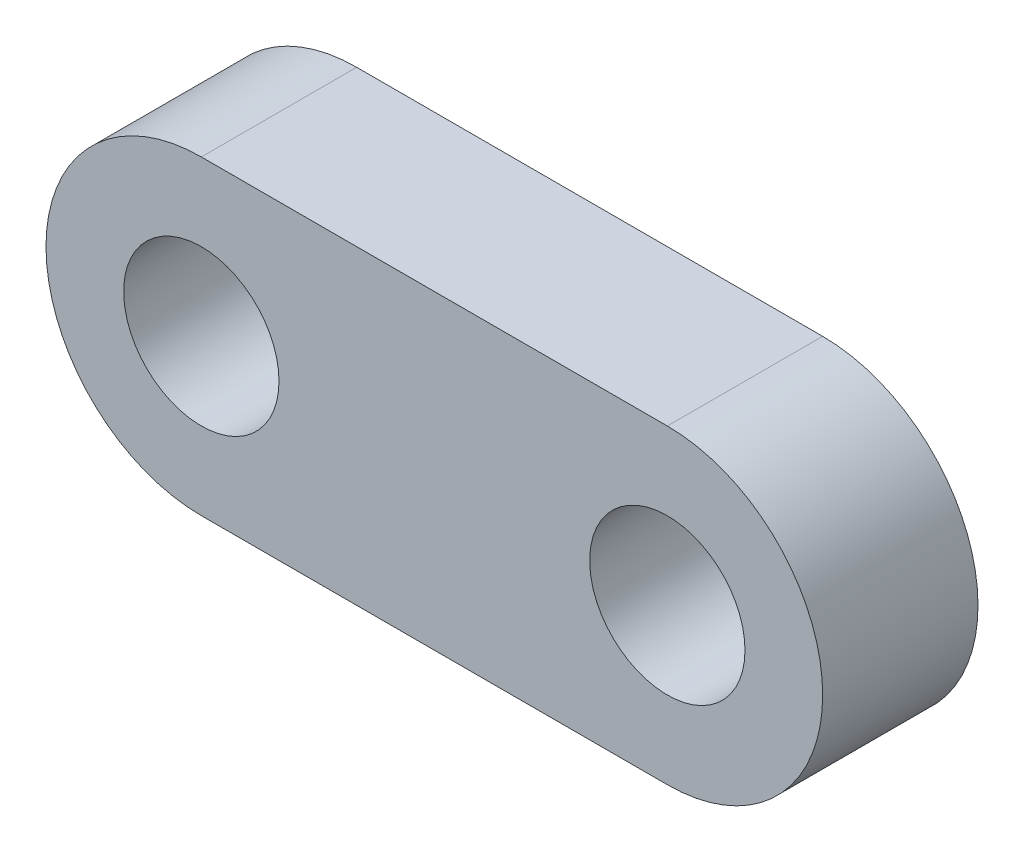
ISO-10303-21;
HEADER;
FILE_DESCRIPTION(('STEP AP214'),'2;1');
FILE_NAME('part.step','',(''),(''),'','','');
FILE_SCHEMA(('AUTOMOTIVE_DESIGN { 1 0 10303 214 1 1 1 1 }'));
ENDSEC;
DATA;
#1=APPLICATION_CONTEXT('core data for automotive mechanical design processes');
#2=APPLICATION_PROTOCOL_DEFINITION('international standard','automotive_design',2000,#1);
#3=PRODUCT_CONTEXT('',#1,'mechanical');
#4=PRODUCT('Part','Part','',(#3));
#5=PRODUCT_RELATED_PRODUCT_CATEGORY('part','',(#4));
#6=PRODUCT_DEFINITION_FORMATION('','',#4);
#7=PRODUCT_DEFINITION_CONTEXT('part definition',#1,'design');
#8=PRODUCT_DEFINITION('design','',#6,#7);
#9=PRODUCT_DEFINITION_SHAPE('','',#8);
#10=(LENGTH_UNIT() NAMED_UNIT(*) SI_UNIT(.MILLI.,.METRE.));
#11=(NAMED_UNIT(*) PLANE_ANGLE_UNIT() SI_UNIT($,.RADIAN.));
#12=(NAMED_UNIT(*) SI_UNIT($,.STERADIAN.) SOLID_ANGLE_UNIT());
#13=UNCERTAINTY_MEASURE_WITH_UNIT(LENGTH_MEASURE(1.E-05),#10,'distance_accuracy_value','');
#14=(GEOMETRIC_REPRESENTATION_CONTEXT(3) GLOBAL_UNCERTAINTY_ASSIGNED_CONTEXT((#13)) GLOBAL_UNIT_ASSIGNED_CONTEXT((#10,
#11,#12)) REPRESENTATION_CONTEXT('',''));
#15=CARTESIAN_POINT('',(0.,0.,0.));
#16=DIRECTION('',(0.,0.,1.));
#17=DIRECTION('',(1.,0.,0.));
#18=AXIS2_PLACEMENT_3D('',#15,#16,#17);
#19=CARTESIAN_POINT('',(0.,0.,6.35));
#20=DIRECTION('',(0.,0.,1.));
#21=DIRECTION('',(1.,0.,0.));
#22=AXIS2_PLACEMENT_3D('',#19,#20,#21);
#23=PLANE('',#22);
#24=CARTESIAN_POINT('',(19.05,0.,6.35));
#25=DIRECTION('',(0.,0.,1.));
#26=DIRECTION('',(1.,0.,0.));
#27=AXIS2_PLACEMENT_3D('',#24,#25,#26);
#28=CIRCLE('',#27,3.175);
#29=CARTESIAN_POINT('',(22.225,0.,6.35));
#30=VERTEX_POINT('',#29);
#31=EDGE_CURVE('E99',#30,#30,#28,.T.);
#32=ORIENTED_EDGE('',*,*,#31,.F.);
#33=EDGE_LOOP('',(#32));
#34=FACE_BOUND('',#33,.T.);
#35=CARTESIAN_POINT('',(0.,0.,6.35));
#36=DIRECTION('',(0.,0.,1.));
#37=DIRECTION('',(1.,0.,0.));
#38=AXIS2_PLACEMENT_3D('',#35,#36,#37);
#39=CIRCLE('',#38,6.35);
#40=CARTESIAN_POINT('',(0.,6.35,6.35));
#41=VERTEX_POINT('',#40);
#42=CARTESIAN_POINT('',(0.,-6.35,6.35));
#43=VERTEX_POINT('',#42);
#44=EDGE_CURVE('E84',#41,#43,#39,.T.);
#45=ORIENTED_EDGE('',*,*,#44,.T.);
#46=DIRECTION('',(1.,0.,0.));
#47=VECTOR('',#46,1.);
#48=CARTESIAN_POINT('',(0.,-6.35,6.35));
#49=LINE('',#48,#47);
#50=CARTESIAN_POINT('',(19.05,-6.35,6.35));
#51=VERTEX_POINT('',#50);
#52=EDGE_CURVE('E79',#43,#51,#49,.T.);
#53=ORIENTED_EDGE('',*,*,#52,.T.);
#54=CARTESIAN_POINT('',(19.05,0.,6.35));
#55=DIRECTION('',(0.,0.,1.));
#56=DIRECTION('',(1.,0.,0.));
#57=AXIS2_PLACEMENT_3D('',#54,#55,#56);
#58=CIRCLE('',#57,6.35);
#59=CARTESIAN_POINT('',(19.05,6.35,6.35));
#60=VERTEX_POINT('',#59);
#61=EDGE_CURVE('E82',#51,#60,#58,.T.);
#62=ORIENTED_EDGE('',*,*,#61,.T.);
#63=DIRECTION('',(-1.,0.,0.));
#64=VECTOR('',#63,1.);
#65=CARTESIAN_POINT('',(0.,6.35,6.35));
#66=LINE('',#65,#64);
#67=EDGE_CURVE('E49',#60,#41,#66,.T.);
#68=ORIENTED_EDGE('',*,*,#67,.T.);
#69=EDGE_LOOP('',(#45,#53,#62,#68));
#70=FACE_BOUND('',#69,.T.);
#71=CARTESIAN_POINT('',(0.,0.,6.35));
#72=DIRECTION('',(0.,0.,1.));
#73=DIRECTION('',(1.,0.,0.));
#74=AXIS2_PLACEMENT_3D('',#71,#72,#73);
#75=CIRCLE('',#74,3.175);
#76=CARTESIAN_POINT('',(3.175,0.,6.35));
#77=VERTEX_POINT('',#76);
#78=EDGE_CURVE('E114',#77,#77,#75,.T.);
#79=ORIENTED_EDGE('',*,*,#78,.F.);
#80=EDGE_LOOP('',(#79));
#81=FACE_BOUND('',#80,.T.);
#82=ADVANCED_FACE('F32',(#34,#70,#81),#23,.T.);
#83=CARTESIAN_POINT('',(0.,0.,0.));
#84=DIRECTION('',(0.,0.,1.));
#85=DIRECTION('',(1.,0.,0.));
#86=AXIS2_PLACEMENT_3D('',#83,#84,#85);
#87=PLANE('',#86);
#88=CARTESIAN_POINT('',(0.,0.,0.));
#89=DIRECTION('',(0.,0.,1.));
#90=DIRECTION('',(1.,0.,0.));
#91=AXIS2_PLACEMENT_3D('',#88,#89,#90);
#92=CIRCLE('',#91,6.35);
#93=CARTESIAN_POINT('',(0.,6.35,0.));
#94=VERTEX_POINT('',#93);
#95=CARTESIAN_POINT('',(0.,-6.35,0.));
#96=VERTEX_POINT('',#95);
#97=EDGE_CURVE('E96',#94,#96,#92,.T.);
#98=ORIENTED_EDGE('',*,*,#97,.F.);
#99=DIRECTION('',(-1.,0.,0.));
#100=VECTOR('',#99,1.);
#101=CARTESIAN_POINT('',(0.,6.35,0.));
#102=LINE('',#101,#100);
#103=CARTESIAN_POINT('',(19.05,6.35,0.));
#104=VERTEX_POINT('',#103);
#105=EDGE_CURVE('E72',#104,#94,#102,.T.);
#106=ORIENTED_EDGE('',*,*,#105,.F.);
#107=CARTESIAN_POINT('',(19.05,0.,0.));
#108=DIRECTION('',(0.,0.,1.));
#109=DIRECTION('',(1.,0.,0.));
#110=AXIS2_PLACEMENT_3D('',#107,#108,#109);
#111=CIRCLE('',#110,6.35);
#112=CARTESIAN_POINT('',(19.05,-6.35,0.));
#113=VERTEX_POINT('',#112);
#114=EDGE_CURVE('E66',#113,#104,#111,.T.);
#115=ORIENTED_EDGE('',*,*,#114,.F.);
#116=DIRECTION('',(1.,0.,0.));
#117=VECTOR('',#116,1.);
#118=CARTESIAN_POINT('',(0.,-6.35,0.));
#119=LINE('',#118,#117);
#120=EDGE_CURVE('E88',#96,#113,#119,.T.);
#121=ORIENTED_EDGE('',*,*,#120,.F.);
#122=EDGE_LOOP('',(#98,#106,#115,#121));
#123=FACE_BOUND('',#122,.T.);
#124=CARTESIAN_POINT('',(19.05,0.,0.));
#125=DIRECTION('',(0.,0.,1.));
#126=DIRECTION('',(1.,0.,0.));
#127=AXIS2_PLACEMENT_3D('',#124,#125,#126);
#128=CIRCLE('',#127,3.175);
#129=CARTESIAN_POINT('',(22.225,0.,0.));
#130=VERTEX_POINT('',#129);
#131=EDGE_CURVE('E111',#130,#130,#128,.T.);
#132=ORIENTED_EDGE('',*,*,#131,.T.);
#133=EDGE_LOOP('',(#132));
#134=FACE_BOUND('',#133,.T.);
#135=CARTESIAN_POINT('',(0.,0.,0.));
#136=DIRECTION('',(0.,0.,1.));
#137=DIRECTION('',(1.,0.,0.));
#138=AXIS2_PLACEMENT_3D('',#135,#136,#137);
#139=CIRCLE('',#138,3.175);
#140=CARTESIAN_POINT('',(3.175,0.,0.));
#141=VERTEX_POINT('',#140);
#142=EDGE_CURVE('E117',#141,#141,#139,.T.);
#143=ORIENTED_EDGE('',*,*,#142,.T.);
#144=EDGE_LOOP('',(#143));
#145=FACE_BOUND('',#144,.T.);
#146=ADVANCED_FACE('F107',(#123,#134,#145),#87,.F.);
#147=CARTESIAN_POINT('',(0.,0.,6.35));
#148=DIRECTION('',(0.,0.,-1.));
#149=DIRECTION('',(-1.,0.,0.));
#150=AXIS2_PLACEMENT_3D('',#147,#148,#149);
#151=CYLINDRICAL_SURFACE('',#150,6.35);
#152=ORIENTED_EDGE('',*,*,#97,.T.);
#153=DIRECTION('',(0.,0.,-1.));
#154=VECTOR('',#153,1.);
#155=CARTESIAN_POINT('',(0.,-6.35,6.35));
#156=LINE('',#155,#154);
#157=EDGE_CURVE('E11',#43,#96,#156,.T.);
#158=ORIENTED_EDGE('',*,*,#157,.F.);
#159=ORIENTED_EDGE('',*,*,#44,.F.);
#160=DIRECTION('',(0.,0.,-1.));
#161=VECTOR('',#160,1.);
#162=CARTESIAN_POINT('',(0.,6.35,6.35));
#163=LINE('',#162,#161);
#164=EDGE_CURVE('E92',#41,#94,#163,.T.);
#165=ORIENTED_EDGE('',*,*,#164,.T.);
#166=EDGE_LOOP('',(#152,#158,#159,#165));
#167=FACE_BOUND('',#166,.T.);
#168=ADVANCED_FACE('F34',(#167),#151,.T.);
#169=CARTESIAN_POINT('',(0.,-6.35,6.35));
#170=DIRECTION('',(0.,1.,0.));
#171=DIRECTION('',(0.,0.,1.));
#172=AXIS2_PLACEMENT_3D('',#169,#170,#171);
#173=PLANE('',#172);
#174=ORIENTED_EDGE('',*,*,#120,.T.);
#175=DIRECTION('',(0.,0.,-1.));
#176=VECTOR('',#175,1.);
#177=CARTESIAN_POINT('',(19.05,-6.35,6.35));
#178=LINE('',#177,#176);
#179=EDGE_CURVE('E41',#51,#113,#178,.T.);
#180=ORIENTED_EDGE('',*,*,#179,.F.);
#181=ORIENTED_EDGE('',*,*,#52,.F.);
#182=ORIENTED_EDGE('',*,*,#157,.T.);
#183=EDGE_LOOP('',(#174,#180,#181,#182));
#184=FACE_BOUND('',#183,.T.);
#185=ADVANCED_FACE('F87',(#184),#173,.F.);
#186=CARTESIAN_POINT('',(19.05,0.,6.35));
#187=DIRECTION('',(0.,0.,-1.));
#188=DIRECTION('',(-1.,0.,0.));
#189=AXIS2_PLACEMENT_3D('',#186,#187,#188);
#190=CYLINDRICAL_SURFACE('',#189,6.35);
#191=ORIENTED_EDGE('',*,*,#114,.T.);
#192=DIRECTION('',(0.,0.,-1.));
#193=VECTOR('',#192,1.);
#194=CARTESIAN_POINT('',(19.05,6.35,6.35));
#195=LINE('',#194,#193);
#196=EDGE_CURVE('E89',#60,#104,#195,.T.);
#197=ORIENTED_EDGE('',*,*,#196,.F.);
#198=ORIENTED_EDGE('',*,*,#61,.F.);
#199=ORIENTED_EDGE('',*,*,#179,.T.);
#200=EDGE_LOOP('',(#191,#197,#198,#199));
#201=FACE_BOUND('',#200,.T.);
#202=ADVANCED_FACE('F90',(#201),#190,.T.);
#203=CARTESIAN_POINT('',(0.,6.35,6.35));
#204=DIRECTION('',(0.,-1.,0.));
#205=DIRECTION('',(0.,0.,-1.));
#206=AXIS2_PLACEMENT_3D('',#203,#204,#205);
#207=PLANE('',#206);
#208=ORIENTED_EDGE('',*,*,#105,.T.);
#209=ORIENTED_EDGE('',*,*,#164,.F.);
#210=ORIENTED_EDGE('',*,*,#67,.F.);
#211=ORIENTED_EDGE('',*,*,#196,.T.);
#212=EDGE_LOOP('',(#208,#209,#210,#211));
#213=FACE_BOUND('',#212,.T.);
#214=ADVANCED_FACE('F104',(#213),#207,.F.);
#215=CARTESIAN_POINT('',(19.05,0.,6.35));
#216=DIRECTION('',(0.,0.,-1.));
#217=DIRECTION('',(-1.,0.,0.));
#218=AXIS2_PLACEMENT_3D('',#215,#216,#217);
#219=CYLINDRICAL_SURFACE('',#218,3.175);
#220=ORIENTED_EDGE('',*,*,#31,.T.);
#221=EDGE_LOOP('',(#220));
#222=FACE_BOUND('',#221,.T.);
#223=ORIENTED_EDGE('',*,*,#131,.F.);
#224=EDGE_LOOP('',(#223));
#225=FACE_BOUND('',#224,.T.);
#226=ADVANCED_FACE('F134',(#222,#225),#219,.F.);
#227=CARTESIAN_POINT('',(0.,0.,6.35));
#228=DIRECTION('',(0.,0.,-1.));
#229=DIRECTION('',(-1.,0.,0.));
#230=AXIS2_PLACEMENT_3D('',#227,#228,#229);
#231=CYLINDRICAL_SURFACE('',#230,3.175);
#232=ORIENTED_EDGE('',*,*,#78,.T.);
#233=EDGE_LOOP('',(#232));
#234=FACE_BOUND('',#233,.T.);
#235=ORIENTED_EDGE('',*,*,#142,.F.);
#236=EDGE_LOOP('',(#235));
#237=FACE_BOUND('',#236,.T.);
#238=ADVANCED_FACE('F123',(#234,#237),#231,.F.);
#239=CLOSED_SHELL('',(#82,#146,#168,#185,#202,#214,#226,#238));
#240=MANIFOLD_SOLID_BREP('B2',#239);
#241=ADVANCED_BREP_SHAPE_REPRESENTATION('',(#18,#240),#14);
#242=SHAPE_DEFINITION_REPRESENTATION(#9,#241);
ENDSEC;
END-ISO-10303-21;
